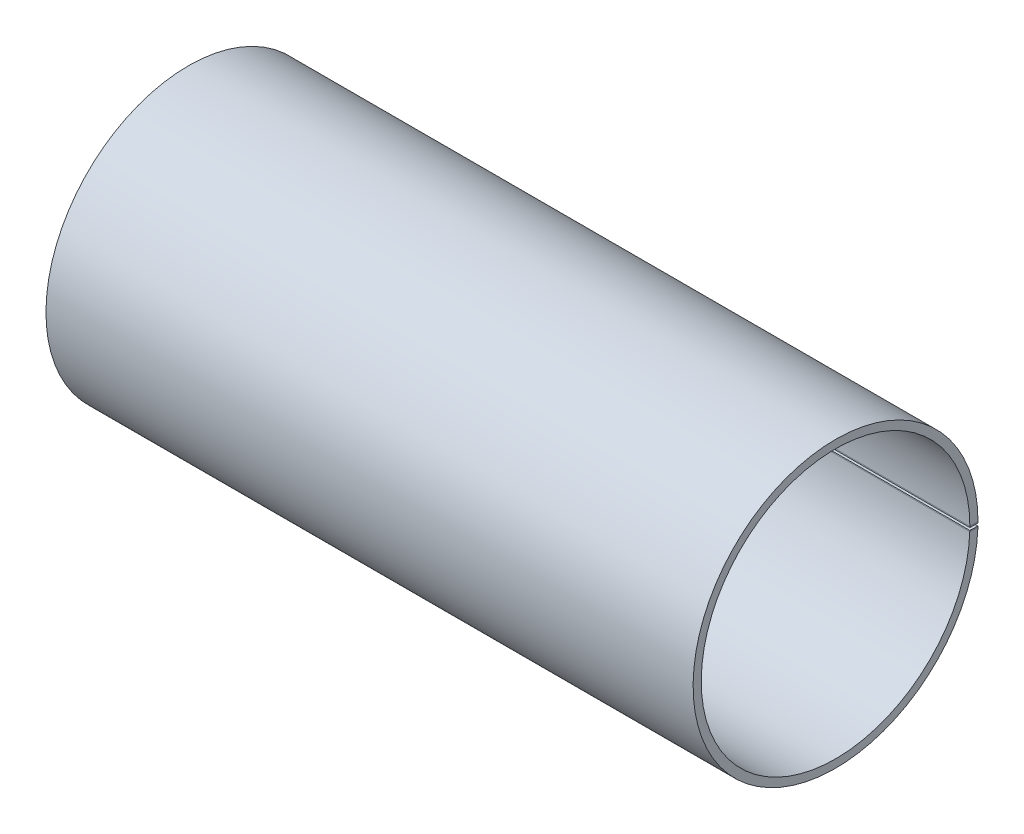
ISO-10303-21;
HEADER;
FILE_DESCRIPTION(('STEP AP214'),'2;1');
FILE_NAME('part.step','',(''),(''),'','','');
FILE_SCHEMA(('AUTOMOTIVE_DESIGN { 1 0 10303 214 1 1 1 1 }'));
ENDSEC;
DATA;
#1=APPLICATION_CONTEXT('core data for automotive mechanical design processes');
#2=APPLICATION_PROTOCOL_DEFINITION('international standard','automotive_design',2000,#1);
#3=PRODUCT_CONTEXT('',#1,'mechanical');
#4=PRODUCT('Part','Part','',(#3));
#5=PRODUCT_RELATED_PRODUCT_CATEGORY('part','',(#4));
#6=PRODUCT_DEFINITION_FORMATION('','',#4);
#7=PRODUCT_DEFINITION_CONTEXT('part definition',#1,'design');
#8=PRODUCT_DEFINITION('design','',#6,#7);
#9=PRODUCT_DEFINITION_SHAPE('','',#8);
#10=(LENGTH_UNIT() NAMED_UNIT(*) SI_UNIT(.MILLI.,.METRE.));
#11=(NAMED_UNIT(*) PLANE_ANGLE_UNIT() SI_UNIT($,.RADIAN.));
#12=(NAMED_UNIT(*) SI_UNIT($,.STERADIAN.) SOLID_ANGLE_UNIT());
#13=UNCERTAINTY_MEASURE_WITH_UNIT(LENGTH_MEASURE(1.E-05),#10,'distance_accuracy_value','');
#14=(GEOMETRIC_REPRESENTATION_CONTEXT(3) GLOBAL_UNCERTAINTY_ASSIGNED_CONTEXT((#13)) GLOBAL_UNIT_ASSIGNED_CONTEXT((#10,
#11,#12)) REPRESENTATION_CONTEXT('',''));
#15=CARTESIAN_POINT('',(0.,0.,0.));
#16=DIRECTION('',(0.,0.,1.));
#17=DIRECTION('',(1.,0.,0.));
#18=AXIS2_PLACEMENT_3D('',#15,#16,#17);
#19=CARTESIAN_POINT('',(-79.5,-0.663129056033995,0.0115749607288579));
#20=DIRECTION('',(0.,-0.0348994967024875,-0.999390827019096));
#21=DIRECTION('',(-1.,0.,0.));
#22=AXIS2_PLACEMENT_3D('',#19,#20,#21);
#23=PLANE('',#22);
#24=DIRECTION('',(0.,0.999390827019096,-0.0348994967024875));
#25=VECTOR('',#24,1.);
#26=CARTESIAN_POINT('',(79.5,-213.533375211101,7.44516775835869));
#27=LINE('',#26,#25);
#28=CARTESIAN_POINT('',(79.5,-0.942220660962195,0.0213210543316342));
#29=VERTEX_POINT('',#28);
#30=CARTESIAN_POINT('',(79.5,-0.663129056033995,0.0115749607288579));
#31=VERTEX_POINT('',#30);
#32=EDGE_CURVE('E157',#29,#31,#27,.T.);
#33=ORIENTED_EDGE('',*,*,#32,.F.);
#34=DIRECTION('',(-1.,0.,0.));
#35=VECTOR('',#34,1.);
#36=CARTESIAN_POINT('',(-79.5,-0.942220660962195,0.0213210543316342));
#37=LINE('',#36,#35);
#38=CARTESIAN_POINT('',(-79.4999999999998,-0.942220660962192,0.0213210543316342));
#39=VERTEX_POINT('',#38);
#40=EDGE_CURVE('E11',#29,#39,#37,.T.);
#41=ORIENTED_EDGE('',*,*,#40,.T.);
#42=DIRECTION('',(0.,-0.999390827019096,0.0348994967024875));
#43=VECTOR('',#42,1.);
#44=CARTESIAN_POINT('',(-79.5,-213.533375211101,7.44516775835869));
#45=LINE('',#44,#43);
#46=CARTESIAN_POINT('',(-79.5,-0.663129056033995,0.0115749607288579));
#47=VERTEX_POINT('',#46);
#48=EDGE_CURVE('E171',#47,#39,#45,.T.);
#49=ORIENTED_EDGE('',*,*,#48,.F.);
#50=DIRECTION('',(-1.,0.,0.));
#51=VECTOR('',#50,1.);
#52=CARTESIAN_POINT('',(-79.5,-0.663129056033995,0.0115749607288579));
#53=LINE('',#52,#51);
#54=EDGE_CURVE('E154',#31,#47,#53,.T.);
#55=ORIENTED_EDGE('',*,*,#54,.F.);
#56=EDGE_LOOP('',(#33,#41,#49,#55));
#57=FACE_BOUND('',#56,.T.);
#58=ADVANCED_FACE('F43',(#57),#23,.T.);
#59=CARTESIAN_POINT('',(-79.5,-213.463576217697,9.44394941239689));
#60=DIRECTION('',(1.,0.,0.));
#61=DIRECTION('',(0.,-0.0348994967024875,-0.999390827019096));
#62=AXIS2_PLACEMENT_3D('',#59,#60,#61);
#63=PLANE('',#62);
#64=DIRECTION('',(0.,-0.0348994967024805,-0.999390827019096));
#65=VECTOR('',#64,1.);
#66=CARTESIAN_POINT('',(-79.5,-0.872421667557188,2.02010270837131));
#67=LINE('',#66,#65);
#68=CARTESIAN_POINT('',(-79.5,-0.872421667557244,2.02010270836982));
#69=VERTEX_POINT('',#68);
#70=EDGE_CURVE('E166',#69,#39,#67,.T.);
#71=ORIENTED_EDGE('',*,*,#70,.F.);
#72=DIRECTION('',(0.,-0.999390827019096,0.0348994967024875));
#73=VECTOR('',#72,1.);
#74=CARTESIAN_POINT('',(-79.5,-213.463576217697,9.44394941239689));
#75=LINE('',#74,#73);
#76=CARTESIAN_POINT('',(-79.5,-0.593330062629016,2.01035661476705));
#77=VERTEX_POINT('',#76);
#78=EDGE_CURVE('E156',#77,#69,#75,.T.);
#79=ORIENTED_EDGE('',*,*,#78,.F.);
#80=DIRECTION('',(0.,-0.0348994967024875,-0.999390827019096));
#81=VECTOR('',#80,1.);
#82=CARTESIAN_POINT('',(-79.5,-0.593330062629016,2.01035661476705));
#83=LINE('',#82,#81);
#84=EDGE_CURVE('E160',#77,#47,#83,.T.);
#85=ORIENTED_EDGE('',*,*,#84,.T.);
#86=ORIENTED_EDGE('',*,*,#48,.T.);
#87=EDGE_LOOP('',(#71,#79,#85,#86));
#88=FACE_BOUND('',#87,.T.);
#89=ADVANCED_FACE('F183',(#88),#63,.F.);
#90=CARTESIAN_POINT('',(79.5,-213.463576217697,9.44394941239689));
#91=DIRECTION('',(-1.,0.,0.));
#92=DIRECTION('',(0.,0.0348994967024875,0.999390827019096));
#93=AXIS2_PLACEMENT_3D('',#90,#91,#92);
#94=PLANE('',#93);
#95=DIRECTION('',(0.,0.0348994967024805,0.999390827019096));
#96=VECTOR('',#95,1.);
#97=CARTESIAN_POINT('',(79.5,-0.872421667557188,2.02010270837131));
#98=LINE('',#97,#96);
#99=CARTESIAN_POINT('',(79.5,-0.872421667557244,2.02010270836982));
#100=VERTEX_POINT('',#99);
#101=EDGE_CURVE('E66',#29,#100,#98,.T.);
#102=ORIENTED_EDGE('',*,*,#101,.F.);
#103=ORIENTED_EDGE('',*,*,#32,.T.);
#104=DIRECTION('',(0.,-0.0348994967024875,-0.999390827019096));
#105=VECTOR('',#104,1.);
#106=CARTESIAN_POINT('',(79.5,-0.593330062629016,2.01035661476705));
#107=LINE('',#106,#105);
#108=CARTESIAN_POINT('',(79.5,-0.593330062629016,2.01035661476705));
#109=VERTEX_POINT('',#108);
#110=EDGE_CURVE('E163',#109,#31,#107,.T.);
#111=ORIENTED_EDGE('',*,*,#110,.F.);
#112=DIRECTION('',(0.,0.999390827019096,-0.0348994967024875));
#113=VECTOR('',#112,1.);
#114=CARTESIAN_POINT('',(79.5,-213.463576217697,9.44394941239689));
#115=LINE('',#114,#113);
#116=EDGE_CURVE('E47',#100,#109,#115,.T.);
#117=ORIENTED_EDGE('',*,*,#116,.F.);
#118=EDGE_LOOP('',(#102,#103,#111,#117));
#119=FACE_BOUND('',#118,.T.);
#120=ADVANCED_FACE('F45',(#119),#94,.F.);
#121=CARTESIAN_POINT('',(-79.5,-0.593330062629016,2.01035661476705));
#122=DIRECTION('',(0.,-0.999390827019096,0.0348994967024875));
#123=DIRECTION('',(0.,-0.0348994967024875,-0.999390827019096));
#124=AXIS2_PLACEMENT_3D('',#121,#122,#123);
#125=PLANE('',#124);
#126=ORIENTED_EDGE('',*,*,#54,.T.);
#127=ORIENTED_EDGE('',*,*,#84,.F.);
#128=DIRECTION('',(-1.,0.,0.));
#129=VECTOR('',#128,1.);
#130=CARTESIAN_POINT('',(-79.5,-0.593330062629016,2.01035661476705));
#131=LINE('',#130,#129);
#132=EDGE_CURVE('E158',#109,#77,#131,.T.);
#133=ORIENTED_EDGE('',*,*,#132,.F.);
#134=ORIENTED_EDGE('',*,*,#110,.T.);
#135=EDGE_LOOP('',(#126,#127,#133,#134));
#136=FACE_BOUND('',#135,.T.);
#137=ADVANCED_FACE('F180',(#136),#125,.F.);
#138=CARTESIAN_POINT('',(-79.5,-0.593330062629016,2.01035661476705));
#139=DIRECTION('',(0.,-0.0348994967024875,-0.999390827019096));
#140=DIRECTION('',(-1.,0.,0.));
#141=AXIS2_PLACEMENT_3D('',#138,#139,#140);
#142=PLANE('',#141);
#143=DIRECTION('',(-1.,0.,0.));
#144=VECTOR('',#143,1.);
#145=CARTESIAN_POINT('',(-79.5,-0.872421667557244,2.02010270836982));
#146=LINE('',#145,#144);
#147=EDGE_CURVE('E52',#100,#69,#146,.T.);
#148=ORIENTED_EDGE('',*,*,#147,.F.);
#149=ORIENTED_EDGE('',*,*,#116,.T.);
#150=ORIENTED_EDGE('',*,*,#132,.T.);
#151=ORIENTED_EDGE('',*,*,#78,.T.);
#152=EDGE_LOOP('',(#148,#149,#150,#151));
#153=FACE_BOUND('',#152,.T.);
#154=ADVANCED_FACE('F175',(#153),#142,.F.);
#155=CARTESIAN_POINT('',(-79.5,0.,2.));
#156=DIRECTION('',(0.,1.,0.));
#157=DIRECTION('',(0.,0.,1.));
#158=AXIS2_PLACEMENT_3D('',#155,#156,#157);
#159=PLANE('',#158);
#160=DIRECTION('',(1.,0.,0.));
#161=VECTOR('',#160,1.);
#162=CARTESIAN_POINT('',(-79.5,0.,0.));
#163=LINE('',#162,#161);
#164=CARTESIAN_POINT('',(-79.5,0.,0.));
#165=VERTEX_POINT('',#164);
#166=CARTESIAN_POINT('',(79.5,0.,0.));
#167=VERTEX_POINT('',#166);
#168=EDGE_CURVE('E150',#165,#167,#163,.T.);
#169=ORIENTED_EDGE('',*,*,#168,.T.);
#170=DIRECTION('',(0.,0.,-1.));
#171=VECTOR('',#170,1.);
#172=CARTESIAN_POINT('',(79.5,0.,2.));
#173=LINE('',#172,#171);
#174=CARTESIAN_POINT('',(79.5,0.,2.));
#175=VERTEX_POINT('',#174);
#176=EDGE_CURVE('E172',#175,#167,#173,.T.);
#177=ORIENTED_EDGE('',*,*,#176,.F.);
#178=DIRECTION('',(1.,0.,0.));
#179=VECTOR('',#178,1.);
#180=CARTESIAN_POINT('',(-79.5,0.,2.));
#181=LINE('',#180,#179);
#182=CARTESIAN_POINT('',(-79.5,0.,2.));
#183=VERTEX_POINT('',#182);
#184=EDGE_CURVE('E122',#183,#175,#181,.T.);
#185=ORIENTED_EDGE('',*,*,#184,.F.);
#186=DIRECTION('',(0.,0.,-1.));
#187=VECTOR('',#186,1.);
#188=CARTESIAN_POINT('',(-79.5,0.,2.));
#189=LINE('',#188,#187);
#190=EDGE_CURVE('E144',#183,#165,#189,.T.);
#191=ORIENTED_EDGE('',*,*,#190,.T.);
#192=EDGE_LOOP('',(#169,#177,#185,#191));
#193=FACE_BOUND('',#192,.T.);
#194=ADVANCED_FACE('F208',(#193),#159,.F.);
#195=CARTESIAN_POINT('',(-79.5,213.,2.));
#196=DIRECTION('',(0.,0.,-1.));
#197=DIRECTION('',(-1.,0.,0.));
#198=AXIS2_PLACEMENT_3D('',#195,#196,#197);
#199=PLANE('',#198);
#200=DIRECTION('',(0.,1.,0.));
#201=VECTOR('',#200,1.);
#202=CARTESIAN_POINT('',(79.5,0.,2.));
#203=LINE('',#202,#201);
#204=CARTESIAN_POINT('',(79.5000000000001,0.279261723624861,2.));
#205=VERTEX_POINT('',#204);
#206=EDGE_CURVE('E139',#175,#205,#203,.T.);
#207=ORIENTED_EDGE('',*,*,#206,.T.);
#208=DIRECTION('',(-1.,0.,0.));
#209=VECTOR('',#208,1.);
#210=CARTESIAN_POINT('',(-79.5,0.279261723624857,2.));
#211=LINE('',#210,#209);
#212=CARTESIAN_POINT('',(-79.4999999999998,0.279261723624861,2.));
#213=VERTEX_POINT('',#212);
#214=EDGE_CURVE('E128',#205,#213,#211,.T.);
#215=ORIENTED_EDGE('',*,*,#214,.T.);
#216=DIRECTION('',(0.,-1.,0.));
#217=VECTOR('',#216,1.);
#218=CARTESIAN_POINT('',(-79.5,0.,2.));
#219=LINE('',#218,#217);
#220=EDGE_CURVE('E136',#213,#183,#219,.T.);
#221=ORIENTED_EDGE('',*,*,#220,.T.);
#222=ORIENTED_EDGE('',*,*,#184,.T.);
#223=EDGE_LOOP('',(#207,#215,#221,#222));
#224=FACE_BOUND('',#223,.T.);
#225=ADVANCED_FACE('F135',(#224),#199,.F.);
#226=CARTESIAN_POINT('',(-79.5,0.,2.));
#227=DIRECTION('',(1.,0.,0.));
#228=DIRECTION('',(0.,0.,-1.));
#229=AXIS2_PLACEMENT_3D('',#226,#227,#228);
#230=PLANE('',#229);
#231=ORIENTED_EDGE('',*,*,#220,.F.);
#232=DIRECTION('',(0.,0.,-1.));
#233=VECTOR('',#232,1.);
#234=CARTESIAN_POINT('',(-79.5,0.279261723624857,2.));
#235=LINE('',#234,#233);
#236=CARTESIAN_POINT('',(-79.5,0.279261723624885,0.));
#237=VERTEX_POINT('',#236);
#238=EDGE_CURVE('E110',#213,#237,#235,.T.);
#239=ORIENTED_EDGE('',*,*,#238,.T.);
#240=DIRECTION('',(0.,-1.,0.));
#241=VECTOR('',#240,1.);
#242=CARTESIAN_POINT('',(-79.5,0.,0.));
#243=LINE('',#242,#241);
#244=EDGE_CURVE('E121',#237,#165,#243,.T.);
#245=ORIENTED_EDGE('',*,*,#244,.T.);
#246=ORIENTED_EDGE('',*,*,#190,.F.);
#247=EDGE_LOOP('',(#231,#239,#245,#246));
#248=FACE_BOUND('',#247,.T.);
#249=ADVANCED_FACE('F142',(#248),#230,.F.);
#250=CARTESIAN_POINT('',(-79.5,213.,0.));
#251=DIRECTION('',(0.,0.,-1.));
#252=DIRECTION('',(-1.,0.,0.));
#253=AXIS2_PLACEMENT_3D('',#250,#251,#252);
#254=PLANE('',#253);
#255=DIRECTION('',(-1.,0.,0.));
#256=VECTOR('',#255,1.);
#257=CARTESIAN_POINT('',(-79.5,0.279261723624885,0.));
#258=LINE('',#257,#256);
#259=CARTESIAN_POINT('',(79.5000000000001,0.279261723624862,0.));
#260=VERTEX_POINT('',#259);
#261=EDGE_CURVE('E152',#260,#237,#258,.T.);
#262=ORIENTED_EDGE('',*,*,#261,.F.);
#263=DIRECTION('',(0.,1.,0.));
#264=VECTOR('',#263,1.);
#265=CARTESIAN_POINT('',(79.5,0.,0.));
#266=LINE('',#265,#264);
#267=EDGE_CURVE('E199',#167,#260,#266,.T.);
#268=ORIENTED_EDGE('',*,*,#267,.F.);
#269=ORIENTED_EDGE('',*,*,#168,.F.);
#270=ORIENTED_EDGE('',*,*,#244,.F.);
#271=EDGE_LOOP('',(#262,#268,#269,#270));
#272=FACE_BOUND('',#271,.T.);
#273=ADVANCED_FACE('F205',(#272),#254,.T.);
#274=CARTESIAN_POINT('',(79.5,0.,2.));
#275=DIRECTION('',(-1.,0.,0.));
#276=DIRECTION('',(0.,0.,1.));
#277=AXIS2_PLACEMENT_3D('',#274,#275,#276);
#278=PLANE('',#277);
#279=ORIENTED_EDGE('',*,*,#267,.T.);
#280=DIRECTION('',(0.,0.,1.));
#281=VECTOR('',#280,1.);
#282=CARTESIAN_POINT('',(79.5,0.279261723624857,2.));
#283=LINE('',#282,#281);
#284=EDGE_CURVE('E196',#260,#205,#283,.T.);
#285=ORIENTED_EDGE('',*,*,#284,.T.);
#286=ORIENTED_EDGE('',*,*,#206,.F.);
#287=ORIENTED_EDGE('',*,*,#176,.T.);
#288=EDGE_LOOP('',(#279,#285,#286,#287));
#289=FACE_BOUND('',#288,.T.);
#290=ADVANCED_FACE('F210',(#289),#278,.F.);
#291=CARTESIAN_POINT('',(79.5,0.279261723624857,35.));
#292=DIRECTION('',(-1.,0.,0.));
#293=DIRECTION('',(0.,0.,1.));
#294=AXIS2_PLACEMENT_3D('',#291,#292,#293);
#295=PLANE('',#294);
#296=ORIENTED_EDGE('',*,*,#101,.T.);
#297=CARTESIAN_POINT('',(79.5000000000001,0.279261723624857,35.));
#298=DIRECTION('',(-1.,0.,0.));
#299=DIRECTION('',(0.,0.,1.));
#300=AXIS2_PLACEMENT_3D('',#297,#298,#299);
#301=CIRCLE('',#300,33.);
#302=EDGE_CURVE('E131',#205,#100,#301,.F.);
#303=ORIENTED_EDGE('',*,*,#302,.F.);
#304=ORIENTED_EDGE('',*,*,#284,.F.);
#305=CARTESIAN_POINT('',(79.5000000000001,0.279261723624857,35.));
#306=DIRECTION('',(-1.,0.,0.));
#307=DIRECTION('',(0.,0.,1.));
#308=AXIS2_PLACEMENT_3D('',#305,#306,#307);
#309=CIRCLE('',#308,35.);
#310=EDGE_CURVE('E130',#260,#29,#309,.F.);
#311=ORIENTED_EDGE('',*,*,#310,.T.);
#312=EDGE_LOOP('',(#296,#303,#304,#311));
#313=FACE_BOUND('',#312,.T.);
#314=ADVANCED_FACE('F212',(#313),#295,.F.);
#315=CARTESIAN_POINT('',(-79.5,0.279261723624857,35.));
#316=DIRECTION('',(1.,0.,0.));
#317=DIRECTION('',(0.,0.,-1.));
#318=AXIS2_PLACEMENT_3D('',#315,#316,#317);
#319=PLANE('',#318);
#320=ORIENTED_EDGE('',*,*,#238,.F.);
#321=CARTESIAN_POINT('',(-79.4999999999998,0.279261723624857,35.));
#322=DIRECTION('',(-1.,0.,0.));
#323=DIRECTION('',(0.,0.,1.));
#324=AXIS2_PLACEMENT_3D('',#321,#322,#323);
#325=CIRCLE('',#324,33.);
#326=EDGE_CURVE('E114',#69,#213,#325,.T.);
#327=ORIENTED_EDGE('',*,*,#326,.F.);
#328=ORIENTED_EDGE('',*,*,#70,.T.);
#329=CARTESIAN_POINT('',(-79.4999999999998,0.279261723624857,35.));
#330=DIRECTION('',(-1.,0.,0.));
#331=DIRECTION('',(0.,0.,1.));
#332=AXIS2_PLACEMENT_3D('',#329,#330,#331);
#333=CIRCLE('',#332,35.);
#334=EDGE_CURVE('E116',#39,#237,#333,.T.);
#335=ORIENTED_EDGE('',*,*,#334,.T.);
#336=EDGE_LOOP('',(#320,#327,#328,#335));
#337=FACE_BOUND('',#336,.T.);
#338=ADVANCED_FACE('F112',(#337),#319,.F.);
#339=CARTESIAN_POINT('',(345.308201528847,0.279261723624857,35.));
#340=DIRECTION('',(-1.,0.,0.));
#341=DIRECTION('',(0.,0.,1.));
#342=AXIS2_PLACEMENT_3D('',#339,#340,#341);
#343=CYLINDRICAL_SURFACE('',#342,35.);
#344=ORIENTED_EDGE('',*,*,#334,.F.);
#345=ORIENTED_EDGE('',*,*,#40,.F.);
#346=ORIENTED_EDGE('',*,*,#310,.F.);
#347=ORIENTED_EDGE('',*,*,#261,.T.);
#348=EDGE_LOOP('',(#344,#345,#346,#347));
#349=FACE_BOUND('',#348,.T.);
#350=ADVANCED_FACE('F186',(#349),#343,.T.);
#351=CARTESIAN_POINT('',(345.308201528847,0.279261723624857,35.));
#352=DIRECTION('',(-1.,0.,0.));
#353=DIRECTION('',(0.,0.,1.));
#354=AXIS2_PLACEMENT_3D('',#351,#352,#353);
#355=CYLINDRICAL_SURFACE('',#354,33.);
#356=ORIENTED_EDGE('',*,*,#326,.T.);
#357=ORIENTED_EDGE('',*,*,#214,.F.);
#358=ORIENTED_EDGE('',*,*,#302,.T.);
#359=ORIENTED_EDGE('',*,*,#147,.T.);
#360=EDGE_LOOP('',(#356,#357,#358,#359));
#361=FACE_BOUND('',#360,.T.);
#362=ADVANCED_FACE('F126',(#361),#355,.F.);
#363=CLOSED_SHELL('',(#58,#89,#120,#137,#154,#194,#225,#249,#273,#290,#314,#338,#350,#362));
#364=MANIFOLD_SOLID_BREP('B2',#363);
#365=ADVANCED_BREP_SHAPE_REPRESENTATION('',(#18,#364),#14);
#366=SHAPE_DEFINITION_REPRESENTATION(#9,#365);
ENDSEC;
END-ISO-10303-21;
